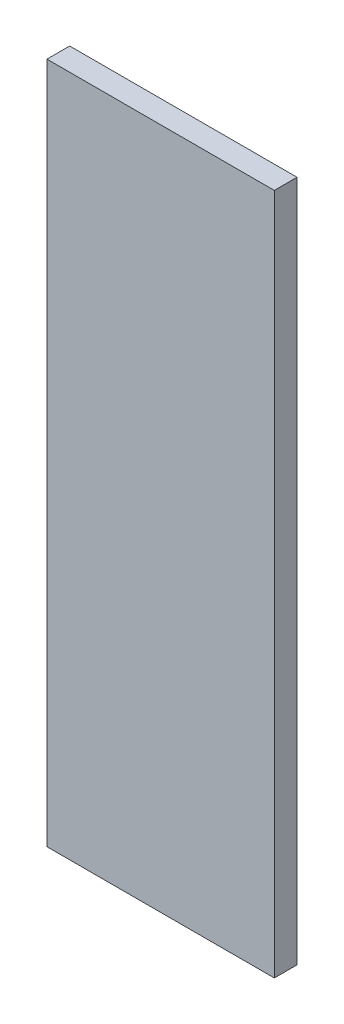
ISO-10303-21;
HEADER;
FILE_DESCRIPTION(('STEP AP214'),'2;1');
FILE_NAME('part.step','',(''),(''),'','','');
FILE_SCHEMA(('AUTOMOTIVE_DESIGN { 1 0 10303 214 1 1 1 1 }'));
ENDSEC;
DATA;
#1=APPLICATION_CONTEXT('core data for automotive mechanical design processes');
#2=APPLICATION_PROTOCOL_DEFINITION('international standard','automotive_design',2000,#1);
#3=PRODUCT_CONTEXT('',#1,'mechanical');
#4=PRODUCT('Part','Part','',(#3));
#5=PRODUCT_RELATED_PRODUCT_CATEGORY('part','',(#4));
#6=PRODUCT_DEFINITION_FORMATION('','',#4);
#7=PRODUCT_DEFINITION_CONTEXT('part definition',#1,'design');
#8=PRODUCT_DEFINITION('design','',#6,#7);
#9=PRODUCT_DEFINITION_SHAPE('','',#8);
#10=(LENGTH_UNIT() NAMED_UNIT(*) SI_UNIT(.MILLI.,.METRE.));
#11=(NAMED_UNIT(*) PLANE_ANGLE_UNIT() SI_UNIT($,.RADIAN.));
#12=(NAMED_UNIT(*) SI_UNIT($,.STERADIAN.) SOLID_ANGLE_UNIT());
#13=UNCERTAINTY_MEASURE_WITH_UNIT(LENGTH_MEASURE(1.E-05),#10,'distance_accuracy_value','');
#14=(GEOMETRIC_REPRESENTATION_CONTEXT(3) GLOBAL_UNCERTAINTY_ASSIGNED_CONTEXT((#13)) GLOBAL_UNIT_ASSIGNED_CONTEXT((#10,
#11,#12)) REPRESENTATION_CONTEXT('',''));
#15=CARTESIAN_POINT('',(0.,0.,0.));
#16=DIRECTION('',(0.,0.,1.));
#17=DIRECTION('',(1.,0.,0.));
#18=AXIS2_PLACEMENT_3D('',#15,#16,#17);
#19=CARTESIAN_POINT('',(31.75,95.25,6.35));
#20=DIRECTION('',(-1.,0.,0.));
#21=DIRECTION('',(0.,-1.,0.));
#22=AXIS2_PLACEMENT_3D('',#19,#20,#21);
#23=PLANE('',#22);
#24=DIRECTION('',(0.,1.,0.));
#25=VECTOR('',#24,1.);
#26=CARTESIAN_POINT('',(31.75,95.25,0.));
#27=LINE('',#26,#25);
#28=CARTESIAN_POINT('',(31.75,-95.25,0.));
#29=VERTEX_POINT('',#28);
#30=CARTESIAN_POINT('',(31.75,95.25,0.));
#31=VERTEX_POINT('',#30);
#32=EDGE_CURVE('E113',#29,#31,#27,.T.);
#33=ORIENTED_EDGE('',*,*,#32,.T.);
#34=DIRECTION('',(0.,0.,-1.));
#35=VECTOR('',#34,1.);
#36=CARTESIAN_POINT('',(31.75,95.25,6.35));
#37=LINE('',#36,#35);
#38=CARTESIAN_POINT('',(31.75,95.25,6.35));
#39=VERTEX_POINT('',#38);
#40=EDGE_CURVE('E11',#39,#31,#37,.T.);
#41=ORIENTED_EDGE('',*,*,#40,.F.);
#42=DIRECTION('',(0.,1.,0.));
#43=VECTOR('',#42,1.);
#44=CARTESIAN_POINT('',(31.75,95.25,6.35));
#45=LINE('',#44,#43);
#46=CARTESIAN_POINT('',(31.75,-95.25,6.35));
#47=VERTEX_POINT('',#46);
#48=EDGE_CURVE('E97',#47,#39,#45,.T.);
#49=ORIENTED_EDGE('',*,*,#48,.F.);
#50=DIRECTION('',(0.,0.,-1.));
#51=VECTOR('',#50,1.);
#52=CARTESIAN_POINT('',(31.75,-95.25,6.35));
#53=LINE('',#52,#51);
#54=EDGE_CURVE('E109',#47,#29,#53,.T.);
#55=ORIENTED_EDGE('',*,*,#54,.T.);
#56=EDGE_LOOP('',(#33,#41,#49,#55));
#57=FACE_BOUND('',#56,.T.);
#58=ADVANCED_FACE('F45',(#57),#23,.F.);
#59=CARTESIAN_POINT('',(-31.75,95.25,6.35));
#60=DIRECTION('',(0.,-1.,0.));
#61=DIRECTION('',(0.,0.,-1.));
#62=AXIS2_PLACEMENT_3D('',#59,#60,#61);
#63=PLANE('',#62);
#64=DIRECTION('',(-1.,0.,0.));
#65=VECTOR('',#64,1.);
#66=CARTESIAN_POINT('',(-31.75,95.25,0.));
#67=LINE('',#66,#65);
#68=CARTESIAN_POINT('',(-31.75,95.25,0.));
#69=VERTEX_POINT('',#68);
#70=EDGE_CURVE('E102',#31,#69,#67,.T.);
#71=ORIENTED_EDGE('',*,*,#70,.T.);
#72=DIRECTION('',(0.,0.,-1.));
#73=VECTOR('',#72,1.);
#74=CARTESIAN_POINT('',(-31.75,95.25,6.35));
#75=LINE('',#74,#73);
#76=CARTESIAN_POINT('',(-31.75,95.25,6.35));
#77=VERTEX_POINT('',#76);
#78=EDGE_CURVE('E54',#77,#69,#75,.T.);
#79=ORIENTED_EDGE('',*,*,#78,.F.);
#80=DIRECTION('',(-1.,0.,0.));
#81=VECTOR('',#80,1.);
#82=CARTESIAN_POINT('',(-31.75,95.25,6.35));
#83=LINE('',#82,#81);
#84=EDGE_CURVE('E92',#39,#77,#83,.T.);
#85=ORIENTED_EDGE('',*,*,#84,.F.);
#86=ORIENTED_EDGE('',*,*,#40,.T.);
#87=EDGE_LOOP('',(#71,#79,#85,#86));
#88=FACE_BOUND('',#87,.T.);
#89=ADVANCED_FACE('F101',(#88),#63,.F.);
#90=CARTESIAN_POINT('',(-31.75,95.25,6.35));
#91=DIRECTION('',(1.,0.,0.));
#92=DIRECTION('',(0.,1.,0.));
#93=AXIS2_PLACEMENT_3D('',#90,#91,#92);
#94=PLANE('',#93);
#95=DIRECTION('',(0.,-1.,0.));
#96=VECTOR('',#95,1.);
#97=CARTESIAN_POINT('',(-31.75,95.25,0.));
#98=LINE('',#97,#96);
#99=CARTESIAN_POINT('',(-31.75,-95.25,0.));
#100=VERTEX_POINT('',#99);
#101=EDGE_CURVE('E79',#69,#100,#98,.T.);
#102=ORIENTED_EDGE('',*,*,#101,.T.);
#103=DIRECTION('',(0.,0.,-1.));
#104=VECTOR('',#103,1.);
#105=CARTESIAN_POINT('',(-31.75,-95.25,6.35));
#106=LINE('',#105,#104);
#107=CARTESIAN_POINT('',(-31.75,-95.25,6.35));
#108=VERTEX_POINT('',#107);
#109=EDGE_CURVE('E104',#108,#100,#106,.T.);
#110=ORIENTED_EDGE('',*,*,#109,.F.);
#111=DIRECTION('',(0.,-1.,0.));
#112=VECTOR('',#111,1.);
#113=CARTESIAN_POINT('',(-31.75,95.25,6.35));
#114=LINE('',#113,#112);
#115=EDGE_CURVE('E95',#77,#108,#114,.T.);
#116=ORIENTED_EDGE('',*,*,#115,.F.);
#117=ORIENTED_EDGE('',*,*,#78,.T.);
#118=EDGE_LOOP('',(#102,#110,#116,#117));
#119=FACE_BOUND('',#118,.T.);
#120=ADVANCED_FACE('F105',(#119),#94,.F.);
#121=CARTESIAN_POINT('',(-31.75,-95.25,6.35));
#122=DIRECTION('',(0.,1.,0.));
#123=DIRECTION('',(0.,0.,1.));
#124=AXIS2_PLACEMENT_3D('',#121,#122,#123);
#125=PLANE('',#124);
#126=DIRECTION('',(1.,0.,0.));
#127=VECTOR('',#126,1.);
#128=CARTESIAN_POINT('',(-31.75,-95.25,0.));
#129=LINE('',#128,#127);
#130=EDGE_CURVE('E85',#100,#29,#129,.T.);
#131=ORIENTED_EDGE('',*,*,#130,.T.);
#132=ORIENTED_EDGE('',*,*,#54,.F.);
#133=DIRECTION('',(1.,0.,0.));
#134=VECTOR('',#133,1.);
#135=CARTESIAN_POINT('',(-31.75,-95.25,6.35));
#136=LINE('',#135,#134);
#137=EDGE_CURVE('E62',#108,#47,#136,.T.);
#138=ORIENTED_EDGE('',*,*,#137,.F.);
#139=ORIENTED_EDGE('',*,*,#109,.T.);
#140=EDGE_LOOP('',(#131,#132,#138,#139));
#141=FACE_BOUND('',#140,.T.);
#142=ADVANCED_FACE('F126',(#141),#125,.F.);
#143=CARTESIAN_POINT('',(0.,0.,6.35));
#144=DIRECTION('',(0.,0.,1.));
#145=DIRECTION('',(1.,0.,0.));
#146=AXIS2_PLACEMENT_3D('',#143,#144,#145);
#147=PLANE('',#146);
#148=ORIENTED_EDGE('',*,*,#48,.T.);
#149=ORIENTED_EDGE('',*,*,#84,.T.);
#150=ORIENTED_EDGE('',*,*,#115,.T.);
#151=ORIENTED_EDGE('',*,*,#137,.T.);
#152=EDGE_LOOP('',(#148,#149,#150,#151));
#153=FACE_BOUND('',#152,.T.);
#154=ADVANCED_FACE('F93',(#153),#147,.T.);
#155=CARTESIAN_POINT('',(0.,0.,0.));
#156=DIRECTION('',(0.,0.,1.));
#157=DIRECTION('',(1.,0.,0.));
#158=AXIS2_PLACEMENT_3D('',#155,#156,#157);
#159=PLANE('',#158);
#160=ORIENTED_EDGE('',*,*,#32,.F.);
#161=ORIENTED_EDGE('',*,*,#130,.F.);
#162=ORIENTED_EDGE('',*,*,#101,.F.);
#163=ORIENTED_EDGE('',*,*,#70,.F.);
#164=EDGE_LOOP('',(#160,#161,#162,#163));
#165=FACE_BOUND('',#164,.T.);
#166=ADVANCED_FACE('F129',(#165),#159,.F.);
#167=CLOSED_SHELL('',(#58,#89,#120,#142,#154,#166));
#168=MANIFOLD_SOLID_BREP('B2',#167);
#169=ADVANCED_BREP_SHAPE_REPRESENTATION('',(#18,#168),#14);
#170=SHAPE_DEFINITION_REPRESENTATION(#9,#169);
ENDSEC;
END-ISO-10303-21;
